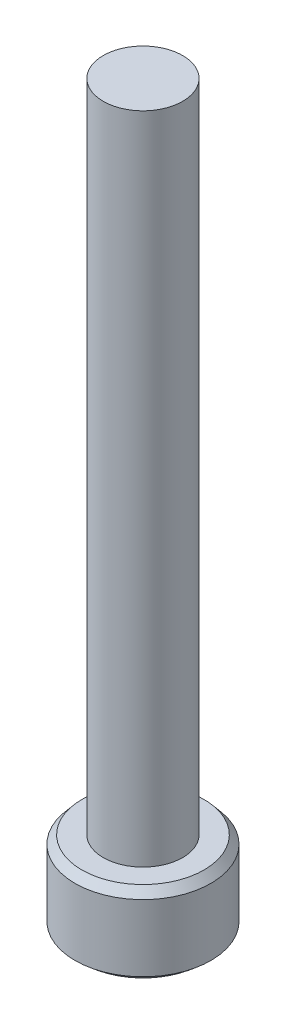
ISO-10303-21;
HEADER;
FILE_DESCRIPTION(('STEP AP214'),'2;1');
FILE_NAME('part.step','',(''),(''),'','','');
FILE_SCHEMA(('AUTOMOTIVE_DESIGN { 1 0 10303 214 1 1 1 1 }'));
ENDSEC;
DATA;
#1=APPLICATION_CONTEXT('core data for automotive mechanical design processes');
#2=APPLICATION_PROTOCOL_DEFINITION('international standard','automotive_design',2000,#1);
#3=PRODUCT_CONTEXT('',#1,'mechanical');
#4=PRODUCT('Part','Part','',(#3));
#5=PRODUCT_RELATED_PRODUCT_CATEGORY('part','',(#4));
#6=PRODUCT_DEFINITION_FORMATION('','',#4);
#7=PRODUCT_DEFINITION_CONTEXT('part definition',#1,'design');
#8=PRODUCT_DEFINITION('design','',#6,#7);
#9=PRODUCT_DEFINITION_SHAPE('','',#8);
#10=(LENGTH_UNIT() NAMED_UNIT(*) SI_UNIT(.MILLI.,.METRE.));
#11=(NAMED_UNIT(*) PLANE_ANGLE_UNIT() SI_UNIT($,.RADIAN.));
#12=(NAMED_UNIT(*) SI_UNIT($,.STERADIAN.) SOLID_ANGLE_UNIT());
#13=UNCERTAINTY_MEASURE_WITH_UNIT(LENGTH_MEASURE(1.E-05),#10,'distance_accuracy_value','');
#14=(GEOMETRIC_REPRESENTATION_CONTEXT(3) GLOBAL_UNCERTAINTY_ASSIGNED_CONTEXT((#13)) GLOBAL_UNIT_ASSIGNED_CONTEXT((#10,
#11,#12)) REPRESENTATION_CONTEXT('',''));
#15=CARTESIAN_POINT('',(0.,0.,0.));
#16=DIRECTION('',(0.,0.,1.));
#17=DIRECTION('',(1.,0.,0.));
#18=AXIS2_PLACEMENT_3D('',#15,#16,#17);
#19=CARTESIAN_POINT('',(0.,5.,0.));
#20=DIRECTION('',(0.,-1.,0.));
#21=DIRECTION('',(0.,0.,-1.));
#22=AXIS2_PLACEMENT_3D('',#19,#20,#21);
#23=CYLINDRICAL_SURFACE('',#22,4.15);
#24=CARTESIAN_POINT('',(0.,0.41954981558863,0.));
#25=DIRECTION('',(0.,1.,0.));
#26=DIRECTION('',(0.,0.,1.));
#27=AXIS2_PLACEMENT_3D('',#24,#25,#26);
#28=CIRCLE('',#27,4.15);
#29=CARTESIAN_POINT('',(0.,0.41954981558863,4.15));
#30=VERTEX_POINT('',#29);
#31=EDGE_CURVE('E198',#30,#30,#28,.T.);
#32=ORIENTED_EDGE('',*,*,#31,.T.);
#33=EDGE_LOOP('',(#32));
#34=FACE_BOUND('',#33,.T.);
#35=CARTESIAN_POINT('',(0.,4.50000000000001,0.));
#36=DIRECTION('',(0.,1.,0.));
#37=DIRECTION('',(0.,0.,1.));
#38=AXIS2_PLACEMENT_3D('',#35,#36,#37);
#39=CIRCLE('',#38,4.15);
#40=CARTESIAN_POINT('',(0.,4.50000000000001,4.15));
#41=VERTEX_POINT('',#40);
#42=EDGE_CURVE('E194',#41,#41,#39,.F.);
#43=ORIENTED_EDGE('',*,*,#42,.T.);
#44=EDGE_LOOP('',(#43));
#45=FACE_BOUND('',#44,.T.);
#46=ADVANCED_FACE('F60',(#34,#45),#23,.T.);
#47=CARTESIAN_POINT('',(0.,5.,0.));
#48=DIRECTION('',(0.,1.,0.));
#49=DIRECTION('',(0.,0.,1.));
#50=AXIS2_PLACEMENT_3D('',#47,#48,#49);
#51=PLANE('',#50);
#52=CARTESIAN_POINT('',(0.,5.,0.));
#53=DIRECTION('',(0.,1.,0.));
#54=DIRECTION('',(0.,0.,1.));
#55=AXIS2_PLACEMENT_3D('',#52,#53,#54);
#56=CIRCLE('',#55,3.73045018441137);
#57=CARTESIAN_POINT('',(0.,5.,3.73045018441137));
#58=VERTEX_POINT('',#57);
#59=EDGE_CURVE('E11',#58,#58,#56,.T.);
#60=ORIENTED_EDGE('',*,*,#59,.T.);
#61=EDGE_LOOP('',(#60));
#62=FACE_BOUND('',#61,.T.);
#63=CARTESIAN_POINT('',(0.,5.,0.));
#64=DIRECTION('',(0.,1.,0.));
#65=DIRECTION('',(0.,0.,1.));
#66=AXIS2_PLACEMENT_3D('',#63,#64,#65);
#67=CIRCLE('',#66,2.425);
#68=CARTESIAN_POINT('',(0.,5.,2.425));
#69=VERTEX_POINT('',#68);
#70=EDGE_CURVE('E190',#69,#69,#67,.T.);
#71=ORIENTED_EDGE('',*,*,#70,.F.);
#72=EDGE_LOOP('',(#71));
#73=FACE_BOUND('',#72,.T.);
#74=ADVANCED_FACE('F217',(#62,#73),#51,.T.);
#75=CARTESIAN_POINT('',(0.,0.,0.));
#76=DIRECTION('',(0.,1.,0.));
#77=DIRECTION('',(0.,0.,1.));
#78=AXIS2_PLACEMENT_3D('',#75,#76,#77);
#79=PLANE('',#78);
#80=CARTESIAN_POINT('',(0.,0.,0.));
#81=DIRECTION('',(0.,1.,0.));
#82=DIRECTION('',(0.,0.,1.));
#83=AXIS2_PLACEMENT_3D('',#80,#81,#82);
#84=CIRCLE('',#83,3.65000000000001);
#85=CARTESIAN_POINT('',(0.,0.,3.65000000000001));
#86=VERTEX_POINT('',#85);
#87=EDGE_CURVE('E70',#86,#86,#84,.F.);
#88=ORIENTED_EDGE('',*,*,#87,.T.);
#89=EDGE_LOOP('',(#88));
#90=FACE_BOUND('',#89,.T.);
#91=DIRECTION('',(-0.866025403784438,0.,-0.500000000000001));
#92=VECTOR('',#91,1.);
#93=CARTESIAN_POINT('',(0.,0.,2.78604186468078));
#94=LINE('',#93,#92);
#95=CARTESIAN_POINT('',(0.,0.,2.78604186468078));
#96=VERTEX_POINT('',#95);
#97=CARTESIAN_POINT('',(-2.41278303082053,0.,1.39302093234039));
#98=VERTEX_POINT('',#97);
#99=EDGE_CURVE('E160',#96,#98,#94,.T.);
#100=ORIENTED_EDGE('',*,*,#99,.F.);
#101=DIRECTION('',(-0.866025403784441,0.,0.499999999999995));
#102=VECTOR('',#101,1.);
#103=CARTESIAN_POINT('',(2.41278303082051,0.,1.39302093234042));
#104=LINE('',#103,#102);
#105=CARTESIAN_POINT('',(2.41278303082051,0.,1.39302093234042));
#106=VERTEX_POINT('',#105);
#107=EDGE_CURVE('E77',#106,#96,#104,.T.);
#108=ORIENTED_EDGE('',*,*,#107,.F.);
#109=DIRECTION('',(0.,0.,1.));
#110=VECTOR('',#109,1.);
#111=CARTESIAN_POINT('',(2.41278303082054,0.,-1.39302093234037));
#112=LINE('',#111,#110);
#113=CARTESIAN_POINT('',(2.41278303082054,0.,-1.39302093234037));
#114=VERTEX_POINT('',#113);
#115=EDGE_CURVE('E172',#114,#106,#112,.T.);
#116=ORIENTED_EDGE('',*,*,#115,.F.);
#117=DIRECTION('',(0.866025403784434,0.,0.500000000000007));
#118=VECTOR('',#117,1.);
#119=CARTESIAN_POINT('',(0.,0.,-2.78604186468078));
#120=LINE('',#119,#118);
#121=CARTESIAN_POINT('',(0.,0.,-2.78604186468078));
#122=VERTEX_POINT('',#121);
#123=EDGE_CURVE('E170',#122,#114,#120,.T.);
#124=ORIENTED_EDGE('',*,*,#123,.F.);
#125=DIRECTION('',(0.866025403784442,0.,-0.499999999999995));
#126=VECTOR('',#125,1.);
#127=CARTESIAN_POINT('',(-2.41278303082052,0.,-1.3930209323404));
#128=LINE('',#127,#126);
#129=CARTESIAN_POINT('',(-2.41278303082052,0.,-1.3930209323404));
#130=VERTEX_POINT('',#129);
#131=EDGE_CURVE('E125',#130,#122,#128,.T.);
#132=ORIENTED_EDGE('',*,*,#131,.F.);
#133=DIRECTION('',(0.,0.,-1.));
#134=VECTOR('',#133,1.);
#135=CARTESIAN_POINT('',(-2.41278303082053,0.,1.39302093234039));
#136=LINE('',#135,#134);
#137=EDGE_CURVE('E164',#98,#130,#136,.T.);
#138=ORIENTED_EDGE('',*,*,#137,.F.);
#139=EDGE_LOOP('',(#100,#108,#116,#124,#132,#138));
#140=FACE_BOUND('',#139,.T.);
#141=ADVANCED_FACE('F207',(#90,#140),#79,.F.);
#142=CARTESIAN_POINT('',(0.,45.,0.));
#143=DIRECTION('',(0.,-1.,0.));
#144=DIRECTION('',(0.,0.,-1.));
#145=AXIS2_PLACEMENT_3D('',#142,#143,#144);
#146=CYLINDRICAL_SURFACE('',#145,2.425);
#147=CARTESIAN_POINT('',(0.,45.,0.));
#148=DIRECTION('',(0.,1.,0.));
#149=DIRECTION('',(0.,0.,1.));
#150=AXIS2_PLACEMENT_3D('',#147,#148,#149);
#151=CIRCLE('',#150,2.425);
#152=CARTESIAN_POINT('',(0.,45.,2.425));
#153=VERTEX_POINT('',#152);
#154=EDGE_CURVE('E178',#153,#153,#151,.T.);
#155=ORIENTED_EDGE('',*,*,#154,.F.);
#156=EDGE_LOOP('',(#155));
#157=FACE_BOUND('',#156,.T.);
#158=ORIENTED_EDGE('',*,*,#70,.T.);
#159=EDGE_LOOP('',(#158));
#160=FACE_BOUND('',#159,.T.);
#161=ADVANCED_FACE('F230',(#157,#160),#146,.T.);
#162=CARTESIAN_POINT('',(0.,45.,0.));
#163=DIRECTION('',(0.,1.,0.));
#164=DIRECTION('',(0.,0.,1.));
#165=AXIS2_PLACEMENT_3D('',#162,#163,#164);
#166=PLANE('',#165);
#167=ORIENTED_EDGE('',*,*,#154,.T.);
#168=EDGE_LOOP('',(#167));
#169=FACE_BOUND('',#168,.T.);
#170=ADVANCED_FACE('F232',(#169),#166,.T.);
#171=CARTESIAN_POINT('',(2.41278303082051,3.,1.39302093234042));
#172=DIRECTION('',(0.499999999999995,0.,0.866025403784441));
#173=DIRECTION('',(0.866025403784441,0.,-0.499999999999995));
#174=AXIS2_PLACEMENT_3D('',#171,#172,#173);
#175=PLANE('',#174);
#176=ORIENTED_EDGE('',*,*,#107,.T.);
#177=DIRECTION('',(0.,-1.,0.));
#178=VECTOR('',#177,1.);
#179=CARTESIAN_POINT('',(0.,3.,2.78604186468078));
#180=LINE('',#179,#178);
#181=CARTESIAN_POINT('',(0.,3.,2.78604186468078));
#182=VERTEX_POINT('',#181);
#183=EDGE_CURVE('E107',#182,#96,#180,.T.);
#184=ORIENTED_EDGE('',*,*,#183,.F.);
#185=DIRECTION('',(-0.866025403784441,0.,0.499999999999995));
#186=VECTOR('',#185,1.);
#187=CARTESIAN_POINT('',(2.41278303082051,3.,1.39302093234042));
#188=LINE('',#187,#186);
#189=CARTESIAN_POINT('',(2.41278303082051,3.,1.39302093234042));
#190=VERTEX_POINT('',#189);
#191=EDGE_CURVE('E175',#190,#182,#188,.T.);
#192=ORIENTED_EDGE('',*,*,#191,.F.);
#193=DIRECTION('',(0.,-1.,0.));
#194=VECTOR('',#193,1.);
#195=CARTESIAN_POINT('',(2.41278303082051,3.,1.39302093234042));
#196=LINE('',#195,#194);
#197=EDGE_CURVE('E85',#190,#106,#196,.T.);
#198=ORIENTED_EDGE('',*,*,#197,.T.);
#199=EDGE_LOOP('',(#176,#184,#192,#198));
#200=FACE_BOUND('',#199,.T.);
#201=ADVANCED_FACE('F238',(#200),#175,.F.);
#202=CARTESIAN_POINT('',(2.41278303082054,3.,-1.39302093234037));
#203=DIRECTION('',(1.,0.,0.));
#204=DIRECTION('',(0.,0.,-1.));
#205=AXIS2_PLACEMENT_3D('',#202,#203,#204);
#206=PLANE('',#205);
#207=ORIENTED_EDGE('',*,*,#115,.T.);
#208=ORIENTED_EDGE('',*,*,#197,.F.);
#209=DIRECTION('',(0.,0.,1.));
#210=VECTOR('',#209,1.);
#211=CARTESIAN_POINT('',(2.41278303082054,3.,-1.39302093234037));
#212=LINE('',#211,#210);
#213=CARTESIAN_POINT('',(2.41278303082054,3.,-1.39302093234037));
#214=VERTEX_POINT('',#213);
#215=EDGE_CURVE('E139',#214,#190,#212,.T.);
#216=ORIENTED_EDGE('',*,*,#215,.F.);
#217=DIRECTION('',(0.,-1.,0.));
#218=VECTOR('',#217,1.);
#219=CARTESIAN_POINT('',(2.41278303082054,3.,-1.39302093234037));
#220=LINE('',#219,#218);
#221=EDGE_CURVE('E130',#214,#114,#220,.T.);
#222=ORIENTED_EDGE('',*,*,#221,.T.);
#223=EDGE_LOOP('',(#207,#208,#216,#222));
#224=FACE_BOUND('',#223,.T.);
#225=ADVANCED_FACE('F252',(#224),#206,.F.);
#226=CARTESIAN_POINT('',(0.,3.,-2.78604186468078));
#227=DIRECTION('',(0.500000000000007,0.,-0.866025403784435));
#228=DIRECTION('',(-0.866025403784434,0.,-0.500000000000007));
#229=AXIS2_PLACEMENT_3D('',#226,#227,#228);
#230=PLANE('',#229);
#231=ORIENTED_EDGE('',*,*,#123,.T.);
#232=ORIENTED_EDGE('',*,*,#221,.F.);
#233=DIRECTION('',(0.866025403784434,0.,0.500000000000007));
#234=VECTOR('',#233,1.);
#235=CARTESIAN_POINT('',(0.,3.,-2.78604186468078));
#236=LINE('',#235,#234);
#237=CARTESIAN_POINT('',(0.,3.,-2.78604186468078));
#238=VERTEX_POINT('',#237);
#239=EDGE_CURVE('E134',#238,#214,#236,.T.);
#240=ORIENTED_EDGE('',*,*,#239,.F.);
#241=DIRECTION('',(0.,-1.,0.));
#242=VECTOR('',#241,1.);
#243=CARTESIAN_POINT('',(0.,3.,-2.78604186468078));
#244=LINE('',#243,#242);
#245=EDGE_CURVE('E118',#238,#122,#244,.T.);
#246=ORIENTED_EDGE('',*,*,#245,.T.);
#247=EDGE_LOOP('',(#231,#232,#240,#246));
#248=FACE_BOUND('',#247,.T.);
#249=ADVANCED_FACE('F135',(#248),#230,.F.);
#250=CARTESIAN_POINT('',(-2.41278303082052,3.,-1.3930209323404));
#251=DIRECTION('',(-0.499999999999995,0.,-0.866025403784441));
#252=DIRECTION('',(-0.866025403784442,0.,0.499999999999995));
#253=AXIS2_PLACEMENT_3D('',#250,#251,#252);
#254=PLANE('',#253);
#255=ORIENTED_EDGE('',*,*,#131,.T.);
#256=ORIENTED_EDGE('',*,*,#245,.F.);
#257=DIRECTION('',(0.866025403784442,0.,-0.499999999999995));
#258=VECTOR('',#257,1.);
#259=CARTESIAN_POINT('',(-2.41278303082052,3.,-1.3930209323404));
#260=LINE('',#259,#258);
#261=CARTESIAN_POINT('',(-2.41278303082052,3.,-1.3930209323404));
#262=VERTEX_POINT('',#261);
#263=EDGE_CURVE('E122',#262,#238,#260,.T.);
#264=ORIENTED_EDGE('',*,*,#263,.F.);
#265=DIRECTION('',(0.,-1.,0.));
#266=VECTOR('',#265,1.);
#267=CARTESIAN_POINT('',(-2.41278303082052,3.,-1.3930209323404));
#268=LINE('',#267,#266);
#269=EDGE_CURVE('E131',#262,#130,#268,.T.);
#270=ORIENTED_EDGE('',*,*,#269,.T.);
#271=EDGE_LOOP('',(#255,#256,#264,#270));
#272=FACE_BOUND('',#271,.T.);
#273=ADVANCED_FACE('F120',(#272),#254,.F.);
#274=CARTESIAN_POINT('',(-2.41278303082053,3.,1.39302093234039));
#275=DIRECTION('',(-1.,0.,0.));
#276=DIRECTION('',(0.,0.,1.));
#277=AXIS2_PLACEMENT_3D('',#274,#275,#276);
#278=PLANE('',#277);
#279=ORIENTED_EDGE('',*,*,#137,.T.);
#280=ORIENTED_EDGE('',*,*,#269,.F.);
#281=DIRECTION('',(0.,0.,-1.));
#282=VECTOR('',#281,1.);
#283=CARTESIAN_POINT('',(-2.41278303082053,3.,1.39302093234039));
#284=LINE('',#283,#282);
#285=CARTESIAN_POINT('',(-2.41278303082053,3.,1.39302093234039));
#286=VERTEX_POINT('',#285);
#287=EDGE_CURVE('E145',#286,#262,#284,.T.);
#288=ORIENTED_EDGE('',*,*,#287,.F.);
#289=DIRECTION('',(0.,-1.,0.));
#290=VECTOR('',#289,1.);
#291=CARTESIAN_POINT('',(-2.41278303082053,3.,1.39302093234039));
#292=LINE('',#291,#290);
#293=EDGE_CURVE('E182',#286,#98,#292,.T.);
#294=ORIENTED_EDGE('',*,*,#293,.T.);
#295=EDGE_LOOP('',(#279,#280,#288,#294));
#296=FACE_BOUND('',#295,.T.);
#297=ADVANCED_FACE('F256',(#296),#278,.F.);
#298=CARTESIAN_POINT('',(0.,3.,2.78604186468078));
#299=DIRECTION('',(-0.500000000000001,0.,0.866025403784438));
#300=DIRECTION('',(0.866025403784438,0.,0.500000000000001));
#301=AXIS2_PLACEMENT_3D('',#298,#299,#300);
#302=PLANE('',#301);
#303=ORIENTED_EDGE('',*,*,#99,.T.);
#304=ORIENTED_EDGE('',*,*,#293,.F.);
#305=DIRECTION('',(-0.866025403784438,0.,-0.500000000000001));
#306=VECTOR('',#305,1.);
#307=CARTESIAN_POINT('',(0.,3.,2.78604186468078));
#308=LINE('',#307,#306);
#309=EDGE_CURVE('E152',#182,#286,#308,.T.);
#310=ORIENTED_EDGE('',*,*,#309,.F.);
#311=ORIENTED_EDGE('',*,*,#183,.T.);
#312=EDGE_LOOP('',(#303,#304,#310,#311));
#313=FACE_BOUND('',#312,.T.);
#314=ADVANCED_FACE('F253',(#313),#302,.F.);
#315=CARTESIAN_POINT('',(0.,3.,0.));
#316=DIRECTION('',(0.,-1.,0.));
#317=DIRECTION('',(0.,0.,-1.));
#318=AXIS2_PLACEMENT_3D('',#315,#316,#317);
#319=PLANE('',#318);
#320=ORIENTED_EDGE('',*,*,#191,.T.);
#321=ORIENTED_EDGE('',*,*,#309,.T.);
#322=ORIENTED_EDGE('',*,*,#287,.T.);
#323=ORIENTED_EDGE('',*,*,#263,.T.);
#324=ORIENTED_EDGE('',*,*,#239,.T.);
#325=ORIENTED_EDGE('',*,*,#215,.T.);
#326=EDGE_LOOP('',(#320,#321,#322,#323,#324,#325));
#327=FACE_BOUND('',#326,.T.);
#328=ADVANCED_FACE('F142',(#327),#319,.T.);
#329=CARTESIAN_POINT('',(0.,0.41954981558863,0.));
#330=DIRECTION('',(0.,1.,0.));
#331=DIRECTION('',(0.,0.,1.));
#332=AXIS2_PLACEMENT_3D('',#329,#330,#331);
#333=CONICAL_SURFACE('',#332,4.15,0.872664625997169);
#334=ORIENTED_EDGE('',*,*,#87,.F.);
#335=EDGE_LOOP('',(#334));
#336=FACE_BOUND('',#335,.T.);
#337=ORIENTED_EDGE('',*,*,#31,.F.);
#338=EDGE_LOOP('',(#337));
#339=FACE_BOUND('',#338,.T.);
#340=ADVANCED_FACE('F210',(#336,#339),#333,.T.);
#341=CARTESIAN_POINT('',(0.,5.,0.));
#342=DIRECTION('',(0.,-1.,0.));
#343=DIRECTION('',(0.,0.,-1.));
#344=AXIS2_PLACEMENT_3D('',#341,#342,#343);
#345=CONICAL_SURFACE('',#344,3.73045018441137,0.698131700797731);
#346=ORIENTED_EDGE('',*,*,#42,.F.);
#347=EDGE_LOOP('',(#346));
#348=FACE_BOUND('',#347,.T.);
#349=ORIENTED_EDGE('',*,*,#59,.F.);
#350=EDGE_LOOP('',(#349));
#351=FACE_BOUND('',#350,.T.);
#352=ADVANCED_FACE('F63',(#348,#351),#345,.T.);
#353=CLOSED_SHELL('',(#46,#74,#141,#161,#170,#201,#225,#249,#273,#297,#314,#328,#340,#352));
#354=MANIFOLD_SOLID_BREP('B2',#353);
#355=ADVANCED_BREP_SHAPE_REPRESENTATION('',(#18,#354),#14);
#356=SHAPE_DEFINITION_REPRESENTATION(#9,#355);
ENDSEC;
END-ISO-10303-21;
